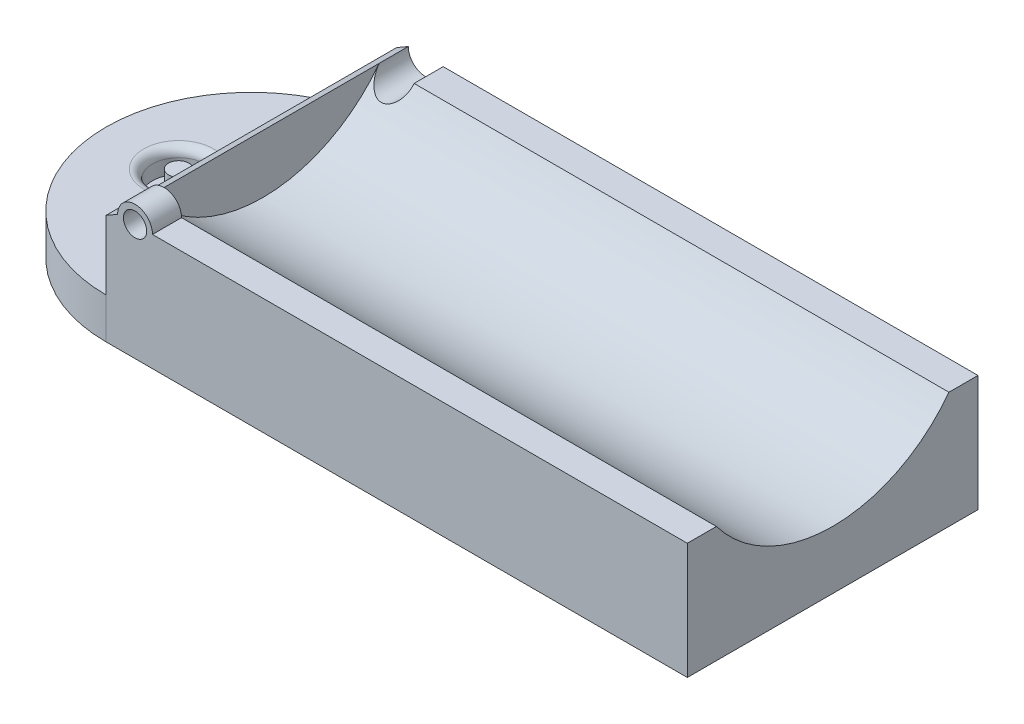
ISO-10303-21;
HEADER;
FILE_DESCRIPTION(('STEP AP214'),'2;1');
FILE_NAME('part.step','',(''),(''),'','','');
FILE_SCHEMA(('AUTOMOTIVE_DESIGN { 1 0 10303 214 1 1 1 1 }'));
ENDSEC;
DATA;
#1=APPLICATION_CONTEXT('core data for automotive mechanical design processes');
#2=APPLICATION_PROTOCOL_DEFINITION('international standard','automotive_design',2000,#1);
#3=PRODUCT_CONTEXT('',#1,'mechanical');
#4=PRODUCT('Part','Part','',(#3));
#5=PRODUCT_RELATED_PRODUCT_CATEGORY('part','',(#4));
#6=PRODUCT_DEFINITION_FORMATION('','',#4);
#7=PRODUCT_DEFINITION_CONTEXT('part definition',#1,'design');
#8=PRODUCT_DEFINITION('design','',#6,#7);
#9=PRODUCT_DEFINITION_SHAPE('','',#8);
#10=(LENGTH_UNIT() NAMED_UNIT(*) SI_UNIT(.MILLI.,.METRE.));
#11=(NAMED_UNIT(*) PLANE_ANGLE_UNIT() SI_UNIT($,.RADIAN.));
#12=(NAMED_UNIT(*) SI_UNIT($,.STERADIAN.) SOLID_ANGLE_UNIT());
#13=UNCERTAINTY_MEASURE_WITH_UNIT(LENGTH_MEASURE(1.E-05),#10,'distance_accuracy_value','');
#14=(GEOMETRIC_REPRESENTATION_CONTEXT(3) GLOBAL_UNCERTAINTY_ASSIGNED_CONTEXT((#13)) GLOBAL_UNIT_ASSIGNED_CONTEXT((#10,
#11,#12)) REPRESENTATION_CONTEXT('',''));
#15=CARTESIAN_POINT('',(0.,0.,0.));
#16=DIRECTION('',(0.,0.,1.));
#17=DIRECTION('',(1.,0.,0.));
#18=AXIS2_PLACEMENT_3D('',#15,#16,#17);
#19=CARTESIAN_POINT('',(0.,20.,0.));
#20=DIRECTION('',(0.,1.,0.));
#21=DIRECTION('',(0.,0.,1.));
#22=AXIS2_PLACEMENT_3D('',#19,#20,#21);
#23=PLANE('',#22);
#24=DIRECTION('',(0.,0.,-1.));
#25=VECTOR('',#24,1.);
#26=CARTESIAN_POINT('',(8.00000000000003,20.,-40.));
#27=LINE('',#26,#25);
#28=CARTESIAN_POINT('',(8.00000000000003,20.,-45.));
#29=VERTEX_POINT('',#28);
#30=CARTESIAN_POINT('',(8.00000000000003,20.,-50.));
#31=VERTEX_POINT('',#30);
#32=EDGE_CURVE('E157',#29,#31,#27,.T.);
#33=ORIENTED_EDGE('',*,*,#32,.F.);
#34=DIRECTION('',(1.,0.,0.));
#35=VECTOR('',#34,1.);
#36=CARTESIAN_POINT('',(0.,20.,-45.));
#37=LINE('',#36,#35);
#38=CARTESIAN_POINT('',(100.,20.,-45.));
#39=VERTEX_POINT('',#38);
#40=EDGE_CURVE('E69',#29,#39,#37,.T.);
#41=ORIENTED_EDGE('',*,*,#40,.T.);
#42=DIRECTION('',(0.,0.,-1.));
#43=VECTOR('',#42,1.);
#44=CARTESIAN_POINT('',(100.,20.,0.));
#45=LINE('',#44,#43);
#46=CARTESIAN_POINT('',(100.,20.,-50.));
#47=VERTEX_POINT('',#46);
#48=EDGE_CURVE('E197',#39,#47,#45,.T.);
#49=ORIENTED_EDGE('',*,*,#48,.T.);
#50=DIRECTION('',(-1.,0.,0.));
#51=VECTOR('',#50,1.);
#52=CARTESIAN_POINT('',(100.,20.,-50.));
#53=LINE('',#52,#51);
#54=EDGE_CURVE('E203',#47,#31,#53,.T.);
#55=ORIENTED_EDGE('',*,*,#54,.T.);
#56=EDGE_LOOP('',(#33,#41,#49,#55));
#57=FACE_BOUND('',#56,.T.);
#58=ADVANCED_FACE('F39',(#57),#23,.T.);
#59=DIRECTION('',(0.,0.,1.));
#60=VECTOR('',#59,1.);
#61=CARTESIAN_POINT('',(8.,20.,-5.00000000000002));
#62=LINE('',#61,#60);
#63=CARTESIAN_POINT('',(8.,20.,0.));
#64=VERTEX_POINT('',#63);
#65=CARTESIAN_POINT('',(8.,20.,-5.));
#66=VERTEX_POINT('',#65);
#67=EDGE_CURVE('E266',#64,#66,#62,.F.);
#68=ORIENTED_EDGE('',*,*,#67,.F.);
#69=DIRECTION('',(1.,0.,0.));
#70=VECTOR('',#69,1.);
#71=CARTESIAN_POINT('',(0.,20.,0.));
#72=LINE('',#71,#70);
#73=CARTESIAN_POINT('',(100.,20.,0.));
#74=VERTEX_POINT('',#73);
#75=EDGE_CURVE('E194',#64,#74,#72,.T.);
#76=ORIENTED_EDGE('',*,*,#75,.T.);
#77=CARTESIAN_POINT('',(100.,20.,-5.));
#78=VERTEX_POINT('',#77);
#79=EDGE_CURVE('E199',#74,#78,#45,.T.);
#80=ORIENTED_EDGE('',*,*,#79,.T.);
#81=DIRECTION('',(1.,0.,0.));
#82=VECTOR('',#81,1.);
#83=CARTESIAN_POINT('',(0.,20.,-5.));
#84=LINE('',#83,#82);
#85=EDGE_CURVE('E174',#66,#78,#84,.T.);
#86=ORIENTED_EDGE('',*,*,#85,.F.);
#87=EDGE_LOOP('',(#68,#76,#80,#86));
#88=FACE_BOUND('',#87,.T.);
#89=ADVANCED_FACE('F317',(#88),#23,.T.);
#90=CARTESIAN_POINT('',(0.,20.,-50.));
#91=DIRECTION('',(1.,0.,0.));
#92=DIRECTION('',(0.,0.,-1.));
#93=AXIS2_PLACEMENT_3D('',#90,#91,#92);
#94=PLANE('',#93);
#95=DIRECTION('',(0.,-1.,0.));
#96=VECTOR('',#95,1.);
#97=CARTESIAN_POINT('',(0.,20.,0.));
#98=LINE('',#97,#96);
#99=CARTESIAN_POINT('',(0.,18.8452994616208,0.));
#100=VERTEX_POINT('',#99);
#101=CARTESIAN_POINT('',(0.,6.99999999999999,0.));
#102=VERTEX_POINT('',#101);
#103=EDGE_CURVE('E225',#100,#102,#98,.T.);
#104=ORIENTED_EDGE('',*,*,#103,.F.);
#105=DIRECTION('',(0.,0.,-1.));
#106=VECTOR('',#105,1.);
#107=CARTESIAN_POINT('',(0.,18.8452994616208,4.00000000000004));
#108=LINE('',#107,#106);
#109=CARTESIAN_POINT('',(0.,18.8452994616208,-50.));
#110=VERTEX_POINT('',#109);
#111=EDGE_CURVE('E346',#100,#110,#108,.T.);
#112=ORIENTED_EDGE('',*,*,#111,.T.);
#113=DIRECTION('',(0.,-1.,0.));
#114=VECTOR('',#113,1.);
#115=CARTESIAN_POINT('',(0.,20.,-50.));
#116=LINE('',#115,#114);
#117=CARTESIAN_POINT('',(0.,6.99999999999999,-50.));
#118=VERTEX_POINT('',#117);
#119=EDGE_CURVE('E207',#110,#118,#116,.T.);
#120=ORIENTED_EDGE('',*,*,#119,.T.);
#121=DIRECTION('',(0.,0.,1.));
#122=VECTOR('',#121,1.);
#123=CARTESIAN_POINT('',(0.,6.99999999999999,-50.));
#124=LINE('',#123,#122);
#125=EDGE_CURVE('E189',#118,#102,#124,.T.);
#126=ORIENTED_EDGE('',*,*,#125,.T.);
#127=EDGE_LOOP('',(#104,#112,#120,#126));
#128=FACE_BOUND('',#127,.T.);
#129=ADVANCED_FACE('F322',(#128),#94,.F.);
#130=CARTESIAN_POINT('',(0.,20.,0.));
#131=DIRECTION('',(0.,0.,-1.));
#132=DIRECTION('',(-1.,0.,0.));
#133=AXIS2_PLACEMENT_3D('',#130,#131,#132);
#134=PLANE('',#133);
#135=CARTESIAN_POINT('',(5.,20.,0.));
#136=DIRECTION('',(0.,0.,1.));
#137=DIRECTION('',(1.,0.,0.));
#138=AXIS2_PLACEMENT_3D('',#135,#136,#137);
#139=CIRCLE('',#138,2.);
#140=CARTESIAN_POINT('',(7.,20.,0.));
#141=VERTEX_POINT('',#140);
#142=EDGE_CURVE('E276',#141,#141,#139,.T.);
#143=ORIENTED_EDGE('',*,*,#142,.F.);
#144=EDGE_LOOP('',(#143));
#145=FACE_BOUND('',#144,.T.);
#146=CARTESIAN_POINT('',(5.,20.,0.));
#147=DIRECTION('',(0.,0.,1.));
#148=DIRECTION('',(1.,0.,0.));
#149=AXIS2_PLACEMENT_3D('',#146,#147,#148);
#150=CIRCLE('',#149,3.);
#151=CARTESIAN_POINT('',(2.,20.,0.));
#152=VERTEX_POINT('',#151);
#153=EDGE_CURVE('E269',#64,#152,#150,.T.);
#154=ORIENTED_EDGE('',*,*,#153,.T.);
#155=DIRECTION('',(-0.866025403784442,-0.499999999999995,0.));
#156=VECTOR('',#155,1.);
#157=CARTESIAN_POINT('',(0.49999999999999,19.1339745962156,0.));
#158=LINE('',#157,#156);
#159=EDGE_CURVE('E352',#152,#100,#158,.T.);
#160=ORIENTED_EDGE('',*,*,#159,.T.);
#161=ORIENTED_EDGE('',*,*,#103,.T.);
#162=DIRECTION('',(0.,-1.,0.));
#163=VECTOR('',#162,1.);
#164=CARTESIAN_POINT('',(0.,0.,0.));
#165=LINE('',#164,#163);
#166=CARTESIAN_POINT('',(0.,0.,0.));
#167=VERTEX_POINT('',#166);
#168=EDGE_CURVE('E186',#102,#167,#165,.T.);
#169=ORIENTED_EDGE('',*,*,#168,.T.);
#170=DIRECTION('',(1.,0.,0.));
#171=VECTOR('',#170,1.);
#172=CARTESIAN_POINT('',(0.,0.,0.));
#173=LINE('',#172,#171);
#174=CARTESIAN_POINT('',(100.,0.,0.));
#175=VERTEX_POINT('',#174);
#176=EDGE_CURVE('E193',#167,#175,#173,.T.);
#177=ORIENTED_EDGE('',*,*,#176,.T.);
#178=DIRECTION('',(0.,-1.,0.));
#179=VECTOR('',#178,1.);
#180=CARTESIAN_POINT('',(100.,20.,0.));
#181=LINE('',#180,#179);
#182=EDGE_CURVE('E221',#74,#175,#181,.T.);
#183=ORIENTED_EDGE('',*,*,#182,.F.);
#184=ORIENTED_EDGE('',*,*,#75,.F.);
#185=EDGE_LOOP('',(#154,#160,#161,#169,#177,#183,#184));
#186=FACE_BOUND('',#185,.T.);
#187=ADVANCED_FACE('F337',(#145,#186),#134,.F.);
#188=CARTESIAN_POINT('',(100.,20.,0.));
#189=DIRECTION('',(-1.,0.,0.));
#190=DIRECTION('',(0.,0.,1.));
#191=AXIS2_PLACEMENT_3D('',#188,#189,#190);
#192=PLANE('',#191);
#193=ORIENTED_EDGE('',*,*,#48,.F.);
#194=CARTESIAN_POINT('',(100.,35.,-25.));
#195=DIRECTION('',(1.,0.,0.));
#196=DIRECTION('',(0.,0.,-1.));
#197=AXIS2_PLACEMENT_3D('',#194,#195,#196);
#198=CIRCLE('',#197,25.);
#199=EDGE_CURVE('E161',#78,#39,#198,.T.);
#200=ORIENTED_EDGE('',*,*,#199,.F.);
#201=ORIENTED_EDGE('',*,*,#79,.F.);
#202=ORIENTED_EDGE('',*,*,#182,.T.);
#203=DIRECTION('',(0.,0.,-1.));
#204=VECTOR('',#203,1.);
#205=CARTESIAN_POINT('',(100.,0.,0.));
#206=LINE('',#205,#204);
#207=CARTESIAN_POINT('',(100.,0.,-50.));
#208=VERTEX_POINT('',#207);
#209=EDGE_CURVE('E210',#175,#208,#206,.T.);
#210=ORIENTED_EDGE('',*,*,#209,.T.);
#211=DIRECTION('',(0.,-1.,0.));
#212=VECTOR('',#211,1.);
#213=CARTESIAN_POINT('',(100.,20.,-50.));
#214=LINE('',#213,#212);
#215=EDGE_CURVE('E217',#47,#208,#214,.T.);
#216=ORIENTED_EDGE('',*,*,#215,.F.);
#217=EDGE_LOOP('',(#193,#200,#201,#202,#210,#216));
#218=FACE_BOUND('',#217,.T.);
#219=ADVANCED_FACE('F333',(#218),#192,.F.);
#220=CARTESIAN_POINT('',(100.,20.,-50.));
#221=DIRECTION('',(0.,0.,1.));
#222=DIRECTION('',(1.,0.,0.));
#223=AXIS2_PLACEMENT_3D('',#220,#221,#222);
#224=PLANE('',#223);
#225=DIRECTION('',(-1.,0.,0.));
#226=VECTOR('',#225,1.);
#227=CARTESIAN_POINT('',(100.,0.,-50.));
#228=LINE('',#227,#226);
#229=CARTESIAN_POINT('',(0.,0.,-50.));
#230=VERTEX_POINT('',#229);
#231=EDGE_CURVE('E198',#208,#230,#228,.T.);
#232=ORIENTED_EDGE('',*,*,#231,.T.);
#233=DIRECTION('',(0.,-1.,0.));
#234=VECTOR('',#233,1.);
#235=CARTESIAN_POINT('',(0.,0.,-50.));
#236=LINE('',#235,#234);
#237=EDGE_CURVE('E182',#118,#230,#236,.T.);
#238=ORIENTED_EDGE('',*,*,#237,.F.);
#239=ORIENTED_EDGE('',*,*,#119,.F.);
#240=DIRECTION('',(-0.866025403784442,-0.499999999999995,0.));
#241=VECTOR('',#240,1.);
#242=CARTESIAN_POINT('',(1.99999999999999,20.,-50.));
#243=LINE('',#242,#241);
#244=CARTESIAN_POINT('',(1.99999999999999,20.,-50.));
#245=VERTEX_POINT('',#244);
#246=EDGE_CURVE('E139',#245,#110,#243,.T.);
#247=ORIENTED_EDGE('',*,*,#246,.F.);
#248=CARTESIAN_POINT('',(5.00000000000001,20.,-50.));
#249=DIRECTION('',(0.,0.,-1.));
#250=DIRECTION('',(-1.,0.,0.));
#251=AXIS2_PLACEMENT_3D('',#248,#249,#250);
#252=CIRCLE('',#251,3.00000000000002);
#253=EDGE_CURVE('E155',#31,#245,#252,.T.);
#254=ORIENTED_EDGE('',*,*,#253,.F.);
#255=ORIENTED_EDGE('',*,*,#54,.F.);
#256=ORIENTED_EDGE('',*,*,#215,.T.);
#257=EDGE_LOOP('',(#232,#238,#239,#247,#254,#255,#256));
#258=FACE_BOUND('',#257,.T.);
#259=ADVANCED_FACE('F329',(#258),#224,.F.);
#260=CARTESIAN_POINT('',(0.,0.,0.));
#261=DIRECTION('',(0.,1.,0.));
#262=DIRECTION('',(0.,0.,1.));
#263=AXIS2_PLACEMENT_3D('',#260,#261,#262);
#264=PLANE('',#263);
#265=ORIENTED_EDGE('',*,*,#209,.F.);
#266=ORIENTED_EDGE('',*,*,#176,.F.);
#267=CARTESIAN_POINT('',(0.,0.,-25.));
#268=DIRECTION('',(0.,-1.,0.));
#269=DIRECTION('',(0.,0.,-1.));
#270=AXIS2_PLACEMENT_3D('',#267,#268,#269);
#271=CIRCLE('',#270,25.);
#272=EDGE_CURVE('E164',#167,#230,#271,.T.);
#273=ORIENTED_EDGE('',*,*,#272,.T.);
#274=ORIENTED_EDGE('',*,*,#231,.F.);
#275=EDGE_LOOP('',(#265,#266,#273,#274));
#276=FACE_BOUND('',#275,.T.);
#277=ADVANCED_FACE('F326',(#276),#264,.F.);
#278=CARTESIAN_POINT('',(0.,6.99999999999999,-25.));
#279=DIRECTION('',(0.,1.,0.));
#280=DIRECTION('',(0.,0.,1.));
#281=AXIS2_PLACEMENT_3D('',#278,#279,#280);
#282=PLANE('',#281);
#283=CARTESIAN_POINT('',(-12.5,6.99999999999999,-25.));
#284=DIRECTION('',(0.,1.,0.));
#285=DIRECTION('',(0.,0.,1.));
#286=AXIS2_PLACEMENT_3D('',#283,#284,#285);
#287=CIRCLE('',#286,6.);
#288=CARTESIAN_POINT('',(-12.5,6.99999999999999,-19.));
#289=VERTEX_POINT('',#288);
#290=EDGE_CURVE('E54',#289,#289,#287,.F.);
#291=ORIENTED_EDGE('',*,*,#290,.T.);
#292=EDGE_LOOP('',(#291));
#293=FACE_BOUND('',#292,.T.);
#294=ORIENTED_EDGE('',*,*,#125,.F.);
#295=CARTESIAN_POINT('',(0.,6.99999999999999,-25.));
#296=DIRECTION('',(0.,-1.,0.));
#297=DIRECTION('',(0.,0.,-1.));
#298=AXIS2_PLACEMENT_3D('',#295,#296,#297);
#299=CIRCLE('',#298,25.);
#300=EDGE_CURVE('E170',#102,#118,#299,.T.);
#301=ORIENTED_EDGE('',*,*,#300,.F.);
#302=EDGE_LOOP('',(#294,#301));
#303=FACE_BOUND('',#302,.T.);
#304=ADVANCED_FACE('F235',(#293,#303),#282,.T.);
#305=CARTESIAN_POINT('',(0.,0.,-25.));
#306=DIRECTION('',(0.,-1.,0.));
#307=DIRECTION('',(0.,0.,-1.));
#308=AXIS2_PLACEMENT_3D('',#305,#306,#307);
#309=CYLINDRICAL_SURFACE('',#308,25.);
#310=ORIENTED_EDGE('',*,*,#168,.F.);
#311=ORIENTED_EDGE('',*,*,#300,.T.);
#312=ORIENTED_EDGE('',*,*,#237,.T.);
#313=ORIENTED_EDGE('',*,*,#272,.F.);
#314=EDGE_LOOP('',(#310,#311,#312,#313));
#315=FACE_BOUND('',#314,.T.);
#316=ADVANCED_FACE('F368',(#315),#309,.T.);
#317=CARTESIAN_POINT('',(0.,35.,-25.));
#318=DIRECTION('',(1.,0.,0.));
#319=DIRECTION('',(0.,0.,-1.));
#320=AXIS2_PLACEMENT_3D('',#317,#318,#319);
#321=CYLINDRICAL_SURFACE('',#320,25.);
#322=CARTESIAN_POINT('',(8.00000000000003,20.,-45.));
#323=CARTESIAN_POINT('',(7.9999892104903,19.898603534373,-44.92396291828));
#324=CARTESIAN_POINT('',(7.9948597354586,19.7978126628336,-44.8471551375387));
#325=CARTESIAN_POINT('',(7.97464712652609,19.5980451148332,-44.692527193926));
#326=CARTESIAN_POINT('',(7.95956567989819,19.4990681337654,-44.614707204858));
#327=CARTESIAN_POINT('',(7.91959085627547,19.3028004523943,-44.4580019091676));
#328=CARTESIAN_POINT('',(7.89462839109461,19.2055267733394,-44.3791129624853));
#329=CARTESIAN_POINT('',(7.8350891275345,19.0139291642517,-44.2213665565126));
#330=CARTESIAN_POINT('',(7.80051156122322,18.9196054704958,-44.1425091002412));
#331=CARTESIAN_POINT('',(7.71957310714273,18.7290758903363,-43.980872590262));
#332=CARTESIAN_POINT('',(7.67264530536355,18.6330779089833,-43.89813122618));
#333=CARTESIAN_POINT('',(7.56816450056442,18.445635973705,-43.734154385819));
#334=CARTESIAN_POINT('',(7.51060942889869,18.354192910823,-43.652919206119));
#335=CARTESIAN_POINT('',(7.38493770186426,18.1768564743634,-43.4931350240908));
#336=CARTESIAN_POINT('',(7.31684841664194,18.0909495137875,-43.4145796868807));
#337=CARTESIAN_POINT('',(7.16985767695386,17.9254003465945,-43.2611823799603));
#338=CARTESIAN_POINT('',(7.09096275483725,17.8457544004369,-43.1863382036877));
#339=CARTESIAN_POINT('',(6.90067697576367,17.674553359182,-43.0234879009055));
#340=CARTESIAN_POINT('',(6.78611362948343,17.5850794678498,-42.9369391609661));
#341=CARTESIAN_POINT('',(6.53935716739615,17.4207995716511,-42.7759646447465));
#342=CARTESIAN_POINT('',(6.4071938369933,17.3459693016564,-42.7015188486051));
#343=CARTESIAN_POINT('',(6.15461077085536,17.2283361992301,-42.5833292764542));
#344=CARTESIAN_POINT('',(6.03728659138791,17.1821142239392,-42.5364204968481));
#345=CARTESIAN_POINT('',(5.79337545627388,17.1039837359781,-42.4566816955209));
#346=CARTESIAN_POINT('',(5.66679531660854,17.0720648117473,-42.4238414337306));
#347=CARTESIAN_POINT('',(5.40628708561009,17.0246738209636,-42.3749491181933));
#348=CARTESIAN_POINT('',(5.27230968307921,17.0093310318205,-42.3590290404999));
#349=CARTESIAN_POINT('',(5.00262617108218,16.9969714193768,-42.3462117271918));
#350=CARTESIAN_POINT('',(4.86692104039654,16.9999446438414,-42.3493041608898));
#351=CARTESIAN_POINT('',(4.61527324599631,17.0224192942688,-42.3725869190029));
#352=CARTESIAN_POINT('',(4.49893386218253,17.039867208858,-42.3906527049167));
#353=CARTESIAN_POINT('',(4.27171195773413,17.0874257224556,-42.4396342241709));
#354=CARTESIAN_POINT('',(4.16083186620162,17.1175419023137,-42.4705556208238));
#355=CARTESIAN_POINT('',(3.91204323587281,17.2002491019459,-42.55486668178));
#356=CARTESIAN_POINT('',(3.77687126942555,17.256950452643,-42.6122817451066));
#357=CARTESIAN_POINT('',(3.52136065069974,17.3857694928424,-42.741116213619));
#358=CARTESIAN_POINT('',(3.40105205730236,17.4579176415452,-42.812563264818));
#359=CARTESIAN_POINT('',(3.13468338971617,17.642963095263,-42.9932042764831));
#360=CARTESIAN_POINT('',(2.99520157853434,17.7611315805521,-43.1066690329037));
#361=CARTESIAN_POINT('',(2.74396508206807,18.0144987135677,-43.344565768993));
#362=CARTESIAN_POINT('',(2.6322479385733,18.1497200509992,-43.4690122929805));
#363=CARTESIAN_POINT('',(2.43305497078937,18.4372481724121,-43.7273495561051));
#364=CARTESIAN_POINT('',(2.34632981581313,18.5899224011425,-43.8614058596842));
#365=CARTESIAN_POINT('',(2.20119629679645,18.9059752507594,-44.1317952499364));
#366=CARTESIAN_POINT('',(2.1427590753151,19.069342769056,-44.2681258689685));
#367=CARTESIAN_POINT('',(2.0661938272649,19.3603657376016,-44.5045433097459));
#368=CARTESIAN_POINT('',(2.04152383611857,19.4862028110938,-44.6047954086127));
#369=CARTESIAN_POINT('',(2.00845051257547,19.7410133683532,-44.8037794905993));
#370=CARTESIAN_POINT('',(2.00003515367598,19.8699844617188,-44.9025125439334));
#371=CARTESIAN_POINT('',(1.99999999999999,20.,-45.));
#372=B_SPLINE_CURVE_WITH_KNOTS('',3,(#322,#323,#324,#325,#326,#327,#328,#329,#330,#331,#332,
#333,#334,#335,#336,#337,#338,#339,#340,#341,#342,#343,#344,#345,#346,#347,#348,#349,#350,#351,
#352,#353,#354,#355,#356,#357,#358,#359,#360,#361,#362,#363,#364,#365,#366,#367,#368,#369,#370,
#371),.UNSPECIFIED.,.F.,.F.,(4,2,2,2,2,2,2,2,2,2,2,2,2,2,2,2,2,2,2,2,2,2,2,2,4),(0.,
0.38007980768493,0.760095192592555,1.14281596182308,1.52556730670654,1.93050839633182,
2.33552839281313,2.73951320581447,3.14325486640683,3.64908855537303,4.15407682295433,
4.55615362508127,4.95793726776316,5.36283229405968,5.76750733499901,6.12298049878439,
6.47861042621191,6.94829688351104,7.4189181785458,8.06093232004308,8.70380989012723,
9.36435700748869,10.0242288517159,10.5117348830431,10.9988800792715),.UNSPECIFIED.);
#373=CARTESIAN_POINT('',(2.,20.,-45.));
#374=VERTEX_POINT('',#373);
#375=EDGE_CURVE('E11',#29,#374,#372,.T.);
#376=ORIENTED_EDGE('',*,*,#375,.T.);
#377=CARTESIAN_POINT('',(2.,35.,-25.));
#378=DIRECTION('',(1.,0.,0.));
#379=DIRECTION('',(0.,0.,-1.));
#380=AXIS2_PLACEMENT_3D('',#377,#378,#379);
#381=CIRCLE('',#380,25.);
#382=CARTESIAN_POINT('',(2.,20.,-5.00000000000002));
#383=VERTEX_POINT('',#382);
#384=EDGE_CURVE('E131',#374,#383,#381,.F.);
#385=ORIENTED_EDGE('',*,*,#384,.T.);
#386=CARTESIAN_POINT('',(3.,20.,-5.00000000000002));
#387=VERTEX_POINT('',#386);
#388=EDGE_CURVE('E165',#383,#387,#84,.T.);
#389=ORIENTED_EDGE('',*,*,#388,.T.);
#390=CARTESIAN_POINT('',(3.,20.,-5.));
#391=CARTESIAN_POINT('',(3.00001300434379,19.932437682245,-5.05066991570102));
#392=CARTESIAN_POINT('',(3.00342397190482,19.8651817690945,-5.10164944082447));
#393=CARTESIAN_POINT('',(3.01695008904886,19.7316093669965,-5.20395686463092));
#394=CARTESIAN_POINT('',(3.02706557178975,19.6652929249,-5.25528478050056));
#395=CARTESIAN_POINT('',(3.06755190559264,19.4671700835144,-5.41022393005085));
#396=CARTESIAN_POINT('',(3.10806029553551,19.3373150521832,-5.51394621859432));
#397=CARTESIAN_POINT('',(3.1898612938495,19.1464900241321,-5.66936557348134));
#398=CARTESIAN_POINT('',(3.22155592182263,19.0822175216927,-5.7222704205733));
#399=CARTESIAN_POINT('',(3.29221612368864,18.9566056248408,-5.82668051512962));
#400=CARTESIAN_POINT('',(3.33118260917333,18.8952665993781,-5.87818558619124));
#401=CARTESIAN_POINT('',(3.45886969002628,18.7169531026482,-6.02932887379553));
#402=CARTESIAN_POINT('',(3.55865786569814,18.6050129609558,-6.1261428405195));
#403=CARTESIAN_POINT('',(3.74500328740218,18.4398156839217,-6.27120977766711));
#404=CARTESIAN_POINT('',(3.82252245103108,18.3802804748946,-6.32407153466146));
#405=CARTESIAN_POINT('',(3.98912826554877,18.27141734059,-6.42152279915529));
#406=CARTESIAN_POINT('',(4.0781979835228,18.2220747424136,-6.46612418826029));
#407=CARTESIAN_POINT('',(4.25031564746256,18.1438553703987,-6.5372619689668));
#408=CARTESIAN_POINT('',(4.33167165822958,18.1129059400151,-6.56559554555794));
#409=CARTESIAN_POINT('',(4.500247126622,18.061445579361,-6.61286857040486));
#410=CARTESIAN_POINT('',(4.58746287919243,18.0409281220878,-6.63181389244819));
#411=CARTESIAN_POINT('',(4.76605861986285,18.0116593425547,-6.65887962621108));
#412=CARTESIAN_POINT('',(4.85745956864418,18.0029759742316,-6.66693751766585));
#413=CARTESIAN_POINT('',(5.04085862925624,17.9983166327494,-6.67125816774008));
#414=CARTESIAN_POINT('',(5.13285657910369,18.0023373455727,-6.66752400246437));
#415=CARTESIAN_POINT('',(5.30569124900381,18.0217670719539,-6.64953003331986));
#416=CARTESIAN_POINT('',(5.38676561892586,18.036072815524,-6.63629008536015));
#417=CARTESIAN_POINT('',(5.54481388109319,18.0739195190377,-6.60140067759968));
#418=CARTESIAN_POINT('',(5.62178692126954,18.0974623896029,-6.57974947801179));
#419=CARTESIAN_POINT('',(5.77529658728593,18.1544465202361,-6.52761775374604));
#420=CARTESIAN_POINT('',(5.85145267931269,18.1884488823502,-6.49663969754689));
#421=CARTESIAN_POINT('',(5.9966772610588,18.264099111169,-6.42818715540706));
#422=CARTESIAN_POINT('',(6.06574142478031,18.30575160168,-6.39070874135823));
#423=CARTESIAN_POINT('',(6.23105697616018,18.4191186035025,-6.28950152871197));
#424=CARTESIAN_POINT('',(6.32234369956553,18.4950738252952,-6.2223800370378));
#425=CARTESIAN_POINT('',(6.48749168986354,18.6580286857621,-6.08038762835896));
#426=CARTESIAN_POINT('',(6.56130790146171,18.7450560097572,-6.00549737568668));
#427=CARTESIAN_POINT('',(6.70800675196122,18.9500881595701,-5.83173086021089));
#428=CARTESIAN_POINT('',(6.7760763602633,19.0704093251201,-5.73152672620364));
#429=CARTESIAN_POINT('',(6.88573035423426,19.3198790219818,-5.52797599749185));
#430=CARTESIAN_POINT('',(6.92733192639663,19.4490217647184,-5.42463148770543));
#431=CARTESIAN_POINT('',(6.97032496417551,19.6496252924653,-5.26744648828187));
#432=CARTESIAN_POINT('',(6.9814317973716,19.7191145512984,-5.21358296218454));
#433=CARTESIAN_POINT('',(6.99625377066774,19.8589640932033,-5.10636284225923));
#434=CARTESIAN_POINT('',(6.99998861585915,19.9293215470477,-5.05300527746303));
#435=CARTESIAN_POINT('',(7.,20.,-4.99999999999999));
#436=B_SPLINE_CURVE_WITH_KNOTS('',3,(#390,#391,#392,#393,#394,#395,#396,#397,#398,#399,#400,
#401,#402,#403,#404,#405,#406,#407,#408,#409,#410,#411,#412,#413,#414,#415,#416,#417,#418,#419,
#420,#421,#422,#423,#424,#425,#426,#427,#428,#429,#430,#431,#432,#433,#434,#435),.UNSPECIFIED.,
.F.,.F.,(4,2,2,2,2,2,2,2,2,2,2,2,2,2,2,2,2,2,2,2,2,2,4),(0.,0.253171611967851,0.506355805373482,
1.01689797036237,1.28381993337847,1.55077537993399,2.08199660729736,2.4142949267099,
2.7461114960064,3.01962350062757,3.29296416496668,3.56786789025481,3.84269990940763,
4.09176012316367,4.34087188009988,4.60680713198539,4.87290364965975,5.2798795236717,
5.68789379552824,6.19754574168282,6.7068664168107,6.97244987263321,7.23732246571067),.UNSPECIFIED.);
#437=CARTESIAN_POINT('',(7.,20.,-5.00000000000002));
#438=VERTEX_POINT('',#437);
#439=EDGE_CURVE('E280',#387,#438,#436,.T.);
#440=ORIENTED_EDGE('',*,*,#439,.T.);
#441=EDGE_CURVE('E172',#438,#66,#84,.T.);
#442=ORIENTED_EDGE('',*,*,#441,.T.);
#443=ORIENTED_EDGE('',*,*,#85,.T.);
#444=ORIENTED_EDGE('',*,*,#199,.T.);
#445=ORIENTED_EDGE('',*,*,#40,.F.);
#446=EDGE_LOOP('',(#376,#385,#389,#440,#442,#443,#444,#445));
#447=FACE_BOUND('',#446,.T.);
#448=ADVANCED_FACE('F159',(#447),#321,.F.);
#449=CARTESIAN_POINT('',(-12.5,2.99999999999997,-25.));
#450=DIRECTION('',(0.,1.,0.));
#451=DIRECTION('',(0.,0.,1.));
#452=AXIS2_PLACEMENT_3D('',#449,#450,#451);
#453=CYLINDRICAL_SURFACE('',#452,4.5);
#454=CARTESIAN_POINT('',(-12.5,5.49999999999999,-25.));
#455=DIRECTION('',(0.,1.,0.));
#456=DIRECTION('',(0.,0.,1.));
#457=AXIS2_PLACEMENT_3D('',#454,#455,#456);
#458=CIRCLE('',#457,4.5);
#459=CARTESIAN_POINT('',(-12.5,5.49999999999999,-20.5));
#460=VERTEX_POINT('',#459);
#461=EDGE_CURVE('E228',#460,#460,#458,.T.);
#462=ORIENTED_EDGE('',*,*,#461,.T.);
#463=EDGE_LOOP('',(#462));
#464=FACE_BOUND('',#463,.T.);
#465=CARTESIAN_POINT('',(-12.5,2.99999999999997,-25.));
#466=DIRECTION('',(0.,1.,0.));
#467=DIRECTION('',(0.,0.,1.));
#468=AXIS2_PLACEMENT_3D('',#465,#466,#467);
#469=CIRCLE('',#468,4.5);
#470=CARTESIAN_POINT('',(-12.5,2.99999999999997,-20.5));
#471=VERTEX_POINT('',#470);
#472=EDGE_CURVE('E251',#471,#471,#469,.T.);
#473=ORIENTED_EDGE('',*,*,#472,.F.);
#474=EDGE_LOOP('',(#473));
#475=FACE_BOUND('',#474,.T.);
#476=ADVANCED_FACE('F244',(#464,#475),#453,.F.);
#477=CARTESIAN_POINT('',(-12.5,2.99999999999997,-25.));
#478=DIRECTION('',(0.,1.,0.));
#479=DIRECTION('',(0.,0.,1.));
#480=AXIS2_PLACEMENT_3D('',#477,#478,#479);
#481=PLANE('',#480);
#482=CARTESIAN_POINT('',(-12.5,2.99999999999997,-25.));
#483=DIRECTION('',(0.,1.,0.));
#484=DIRECTION('',(0.,0.,1.));
#485=AXIS2_PLACEMENT_3D('',#482,#483,#484);
#486=CIRCLE('',#485,1.75);
#487=CARTESIAN_POINT('',(-12.5,2.99999999999997,-23.25));
#488=VERTEX_POINT('',#487);
#489=EDGE_CURVE('E254',#488,#488,#486,.T.);
#490=ORIENTED_EDGE('',*,*,#489,.F.);
#491=EDGE_LOOP('',(#490));
#492=FACE_BOUND('',#491,.T.);
#493=ORIENTED_EDGE('',*,*,#472,.T.);
#494=EDGE_LOOP('',(#493));
#495=FACE_BOUND('',#494,.T.);
#496=ADVANCED_FACE('F247',(#492,#495),#481,.T.);
#497=CARTESIAN_POINT('',(-12.5,2.99999999999997,-25.));
#498=DIRECTION('',(0.,1.,0.));
#499=DIRECTION('',(0.,0.,1.));
#500=AXIS2_PLACEMENT_3D('',#497,#498,#499);
#501=CYLINDRICAL_SURFACE('',#500,1.75);
#502=ORIENTED_EDGE('',*,*,#489,.T.);
#503=EDGE_LOOP('',(#502));
#504=FACE_BOUND('',#503,.T.);
#505=CARTESIAN_POINT('',(-12.5,6.99999999999999,-25.));
#506=DIRECTION('',(0.,1.,0.));
#507=DIRECTION('',(0.,0.,1.));
#508=AXIS2_PLACEMENT_3D('',#505,#506,#507);
#509=CIRCLE('',#508,1.75);
#510=CARTESIAN_POINT('',(-12.5,6.99999999999999,-23.25));
#511=VERTEX_POINT('',#510);
#512=EDGE_CURVE('E258',#511,#511,#509,.T.);
#513=ORIENTED_EDGE('',*,*,#512,.F.);
#514=EDGE_LOOP('',(#513));
#515=FACE_BOUND('',#514,.T.);
#516=ADVANCED_FACE('F307',(#504,#515),#501,.T.);
#517=ORIENTED_EDGE('',*,*,#512,.T.);
#518=EDGE_LOOP('',(#517));
#519=FACE_BOUND('',#518,.T.);
#520=ADVANCED_FACE('F241',(#519),#282,.T.);
#521=CARTESIAN_POINT('',(-12.5,5.49999999999999,-25.));
#522=DIRECTION('',(0.,1.,0.));
#523=DIRECTION('',(0.,0.,1.));
#524=AXIS2_PLACEMENT_3D('',#521,#522,#523);
#525=TOROIDAL_SURFACE('',#524,6.,1.5);
#526=ORIENTED_EDGE('',*,*,#290,.F.);
#527=EDGE_LOOP('',(#526));
#528=FACE_BOUND('',#527,.T.);
#529=ORIENTED_EDGE('',*,*,#461,.F.);
#530=EDGE_LOOP('',(#529));
#531=FACE_BOUND('',#530,.T.);
#532=ADVANCED_FACE('F41',(#528,#531),#525,.T.);
#533=CARTESIAN_POINT('',(5.,20.,-5.00000000000002));
#534=DIRECTION('',(0.,0.,1.));
#535=DIRECTION('',(1.,0.,0.));
#536=AXIS2_PLACEMENT_3D('',#533,#534,#535);
#537=PLANE('',#536);
#538=CARTESIAN_POINT('',(5.,20.,-5.00000000000002));
#539=DIRECTION('',(0.,0.,1.));
#540=DIRECTION('',(1.,0.,0.));
#541=AXIS2_PLACEMENT_3D('',#538,#539,#540);
#542=CIRCLE('',#541,3.);
#543=EDGE_CURVE('E61',#66,#383,#542,.T.);
#544=ORIENTED_EDGE('',*,*,#543,.F.);
#545=ORIENTED_EDGE('',*,*,#441,.F.);
#546=CARTESIAN_POINT('',(5.,20.,-5.00000000000002));
#547=DIRECTION('',(0.,0.,1.));
#548=DIRECTION('',(1.,0.,0.));
#549=AXIS2_PLACEMENT_3D('',#546,#547,#548);
#550=CIRCLE('',#549,2.);
#551=EDGE_CURVE('E273',#438,#387,#550,.T.);
#552=ORIENTED_EDGE('',*,*,#551,.T.);
#553=ORIENTED_EDGE('',*,*,#388,.F.);
#554=EDGE_LOOP('',(#544,#545,#552,#553));
#555=FACE_BOUND('',#554,.T.);
#556=ADVANCED_FACE('F240',(#555),#537,.F.);
#557=CARTESIAN_POINT('',(5.,20.,-5.00000000000002));
#558=DIRECTION('',(0.,0.,1.));
#559=DIRECTION('',(1.,0.,0.));
#560=AXIS2_PLACEMENT_3D('',#557,#558,#559);
#561=CYLINDRICAL_SURFACE('',#560,3.);
#562=ORIENTED_EDGE('',*,*,#543,.T.);
#563=DIRECTION('',(0.,0.,1.));
#564=VECTOR('',#563,1.);
#565=CARTESIAN_POINT('',(2.,20.,-5.00000000000002));
#566=LINE('',#565,#564);
#567=EDGE_CURVE('E148',#383,#152,#566,.T.);
#568=ORIENTED_EDGE('',*,*,#567,.T.);
#569=ORIENTED_EDGE('',*,*,#153,.F.);
#570=ORIENTED_EDGE('',*,*,#67,.T.);
#571=EDGE_LOOP('',(#562,#568,#569,#570));
#572=FACE_BOUND('',#571,.T.);
#573=ADVANCED_FACE('F300',(#572),#561,.T.);
#574=CARTESIAN_POINT('',(5.,20.,-5.00000000000002));
#575=DIRECTION('',(0.,0.,1.));
#576=DIRECTION('',(1.,0.,0.));
#577=AXIS2_PLACEMENT_3D('',#574,#575,#576);
#578=CYLINDRICAL_SURFACE('',#577,2.);
#579=ORIENTED_EDGE('',*,*,#142,.T.);
#580=EDGE_LOOP('',(#579));
#581=FACE_BOUND('',#580,.T.);
#582=ORIENTED_EDGE('',*,*,#439,.F.);
#583=ORIENTED_EDGE('',*,*,#551,.F.);
#584=EDGE_LOOP('',(#582,#583));
#585=FACE_BOUND('',#584,.T.);
#586=ADVANCED_FACE('F297',(#581,#585),#578,.F.);
#587=CARTESIAN_POINT('',(5.00000000000001,20.,-40.));
#588=DIRECTION('',(0.,0.,-1.));
#589=DIRECTION('',(-1.,0.,0.));
#590=AXIS2_PLACEMENT_3D('',#587,#588,#589);
#591=CYLINDRICAL_SURFACE('',#590,3.00000000000002);
#592=ORIENTED_EDGE('',*,*,#32,.T.);
#593=ORIENTED_EDGE('',*,*,#253,.T.);
#594=DIRECTION('',(0.,0.,-1.));
#595=VECTOR('',#594,1.);
#596=CARTESIAN_POINT('',(2.,20.,-40.));
#597=LINE('',#596,#595);
#598=EDGE_CURVE('E145',#245,#374,#597,.F.);
#599=ORIENTED_EDGE('',*,*,#598,.T.);
#600=ORIENTED_EDGE('',*,*,#375,.F.);
#601=EDGE_LOOP('',(#592,#593,#599,#600));
#602=FACE_BOUND('',#601,.T.);
#603=ADVANCED_FACE('F153',(#602),#591,.F.);
#604=CARTESIAN_POINT('',(2.,20.,4.00000000000004));
#605=DIRECTION('',(0.499999999999995,-0.866025403784442,0.));
#606=DIRECTION('',(0.866025403784442,0.499999999999995,0.));
#607=AXIS2_PLACEMENT_3D('',#604,#605,#606);
#608=PLANE('',#607);
#609=ORIENTED_EDGE('',*,*,#567,.F.);
#610=DIRECTION('',(0.,0.,-1.));
#611=VECTOR('',#610,1.);
#612=CARTESIAN_POINT('',(2.,20.,0.));
#613=LINE('',#612,#611);
#614=EDGE_CURVE('E134',#383,#374,#613,.T.);
#615=ORIENTED_EDGE('',*,*,#614,.T.);
#616=ORIENTED_EDGE('',*,*,#598,.F.);
#617=ORIENTED_EDGE('',*,*,#246,.T.);
#618=ORIENTED_EDGE('',*,*,#111,.F.);
#619=ORIENTED_EDGE('',*,*,#159,.F.);
#620=EDGE_LOOP('',(#609,#615,#616,#617,#618,#619));
#621=FACE_BOUND('',#620,.T.);
#622=ADVANCED_FACE('F143',(#621),#608,.F.);
#623=CARTESIAN_POINT('',(2.,20.,0.));
#624=DIRECTION('',(1.,0.,0.));
#625=DIRECTION('',(0.,0.,-1.));
#626=AXIS2_PLACEMENT_3D('',#623,#624,#625);
#627=PLANE('',#626);
#628=ORIENTED_EDGE('',*,*,#384,.F.);
#629=ORIENTED_EDGE('',*,*,#614,.F.);
#630=EDGE_LOOP('',(#628,#629));
#631=FACE_BOUND('',#630,.T.);
#632=ADVANCED_FACE('F133',(#631),#627,.T.);
#633=CLOSED_SHELL('',(#58,#89,#129,#187,#219,#259,#277,#304,#316,#448,#476,#496,#516,#520,#532,
#556,#573,#586,#603,#622,#632));
#634=MANIFOLD_SOLID_BREP('B2',#633);
#635=ADVANCED_BREP_SHAPE_REPRESENTATION('',(#18,#634),#14);
#636=SHAPE_DEFINITION_REPRESENTATION(#9,#635);
ENDSEC;
END-ISO-10303-21;
